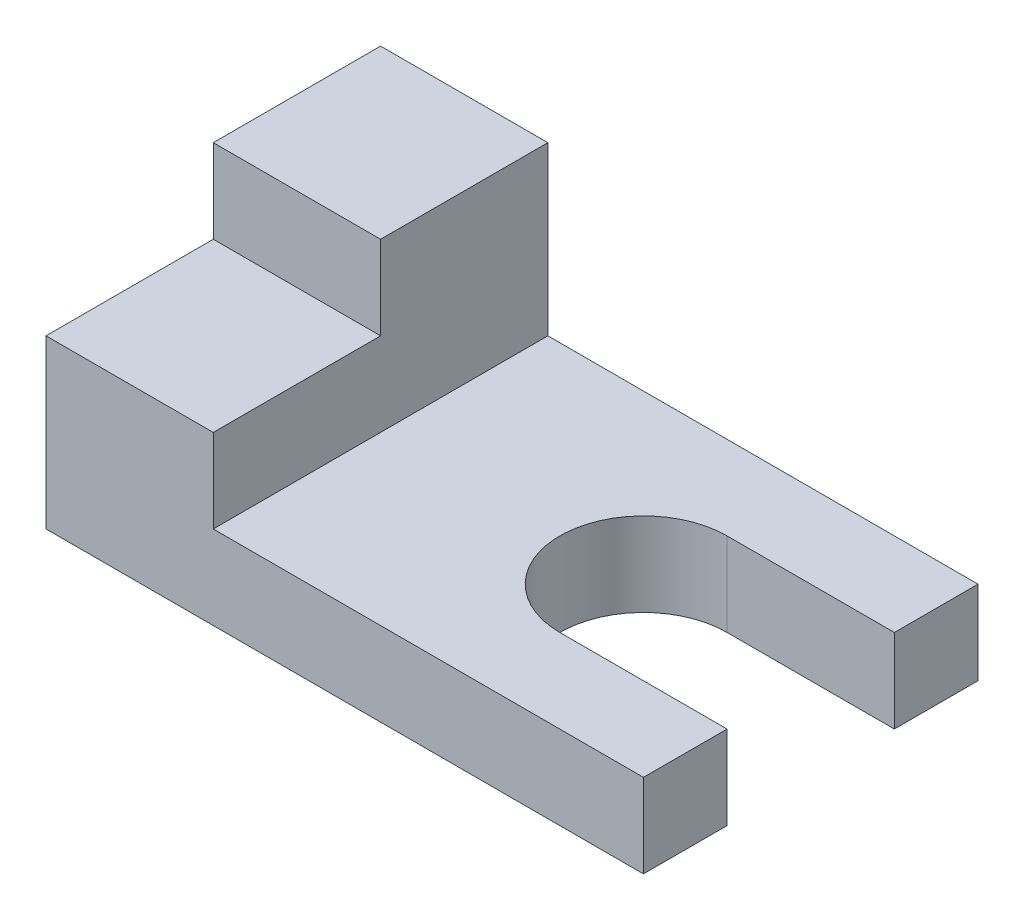
ISO-10303-21;
HEADER;
FILE_DESCRIPTION(('STEP AP214'),'2;1');
FILE_NAME('part.step','',(''),(''),'','','');
FILE_SCHEMA(('AUTOMOTIVE_DESIGN { 1 0 10303 214 1 1 1 1 }'));
ENDSEC;
DATA;
#1=APPLICATION_CONTEXT('core data for automotive mechanical design processes');
#2=APPLICATION_PROTOCOL_DEFINITION('international standard','automotive_design',2000,#1);
#3=PRODUCT_CONTEXT('',#1,'mechanical');
#4=PRODUCT('Part','Part','',(#3));
#5=PRODUCT_RELATED_PRODUCT_CATEGORY('part','',(#4));
#6=PRODUCT_DEFINITION_FORMATION('','',#4);
#7=PRODUCT_DEFINITION_CONTEXT('part definition',#1,'design');
#8=PRODUCT_DEFINITION('design','',#6,#7);
#9=PRODUCT_DEFINITION_SHAPE('','',#8);
#10=(LENGTH_UNIT() NAMED_UNIT(*) SI_UNIT(.MILLI.,.METRE.));
#11=(NAMED_UNIT(*) PLANE_ANGLE_UNIT() SI_UNIT($,.RADIAN.));
#12=(NAMED_UNIT(*) SI_UNIT($,.STERADIAN.) SOLID_ANGLE_UNIT());
#13=UNCERTAINTY_MEASURE_WITH_UNIT(LENGTH_MEASURE(1.E-05),#10,'distance_accuracy_value','');
#14=(GEOMETRIC_REPRESENTATION_CONTEXT(3) GLOBAL_UNCERTAINTY_ASSIGNED_CONTEXT((#13)) GLOBAL_UNIT_ASSIGNED_CONTEXT((#10,
#11,#12)) REPRESENTATION_CONTEXT('',''));
#15=CARTESIAN_POINT('',(0.,0.,0.));
#16=DIRECTION('',(0.,0.,1.));
#17=DIRECTION('',(1.,0.,0.));
#18=AXIS2_PLACEMENT_3D('',#15,#16,#17);
#19=CARTESIAN_POINT('',(-14.,7.,0.));
#20=DIRECTION('',(0.,1.,0.));
#21=DIRECTION('',(0.,0.,1.));
#22=AXIS2_PLACEMENT_3D('',#19,#20,#21);
#23=PLANE('',#22);
#24=DIRECTION('',(1.,0.,0.));
#25=VECTOR('',#24,1.);
#26=CARTESIAN_POINT('',(0.,7.,-14.));
#27=LINE('',#26,#25);
#28=CARTESIAN_POINT('',(-36.,7.,-14.));
#29=VERTEX_POINT('',#28);
#30=CARTESIAN_POINT('',(0.,7.,-14.));
#31=VERTEX_POINT('',#30);
#32=EDGE_CURVE('E169',#29,#31,#27,.T.);
#33=ORIENTED_EDGE('',*,*,#32,.F.);
#34=DIRECTION('',(0.,0.,1.));
#35=VECTOR('',#34,1.);
#36=CARTESIAN_POINT('',(-36.,7.,0.));
#37=LINE('',#36,#35);
#38=CARTESIAN_POINT('',(-36.,7.,14.));
#39=VERTEX_POINT('',#38);
#40=EDGE_CURVE('E56',#29,#39,#37,.T.);
#41=ORIENTED_EDGE('',*,*,#40,.T.);
#42=DIRECTION('',(1.,0.,0.));
#43=VECTOR('',#42,1.);
#44=CARTESIAN_POINT('',(0.,7.,14.));
#45=LINE('',#44,#43);
#46=CARTESIAN_POINT('',(0.,7.,14.));
#47=VERTEX_POINT('',#46);
#48=EDGE_CURVE('E197',#39,#47,#45,.T.);
#49=ORIENTED_EDGE('',*,*,#48,.T.);
#50=DIRECTION('',(0.,0.,-1.));
#51=VECTOR('',#50,1.);
#52=CARTESIAN_POINT('',(0.,7.,7.));
#53=LINE('',#52,#51);
#54=CARTESIAN_POINT('',(0.,7.,7.));
#55=VERTEX_POINT('',#54);
#56=EDGE_CURVE('E199',#47,#55,#53,.T.);
#57=ORIENTED_EDGE('',*,*,#56,.T.);
#58=DIRECTION('',(-1.,0.,0.));
#59=VECTOR('',#58,1.);
#60=CARTESIAN_POINT('',(-14.,7.,7.));
#61=LINE('',#60,#59);
#62=CARTESIAN_POINT('',(-14.,7.,7.));
#63=VERTEX_POINT('',#62);
#64=EDGE_CURVE('E202',#55,#63,#61,.T.);
#65=ORIENTED_EDGE('',*,*,#64,.T.);
#66=CARTESIAN_POINT('',(-14.,7.,0.));
#67=DIRECTION('',(0.,-1.,0.));
#68=DIRECTION('',(0.,0.,1.));
#69=AXIS2_PLACEMENT_3D('',#66,#67,#68);
#70=CIRCLE('',#69,7.);
#71=CARTESIAN_POINT('',(-14.,7.,-7.));
#72=VERTEX_POINT('',#71);
#73=EDGE_CURVE('E204',#63,#72,#70,.T.);
#74=ORIENTED_EDGE('',*,*,#73,.T.);
#75=DIRECTION('',(-1.,0.,0.));
#76=VECTOR('',#75,1.);
#77=CARTESIAN_POINT('',(-14.,7.,-7.));
#78=LINE('',#77,#76);
#79=CARTESIAN_POINT('',(0.,7.,-7.));
#80=VERTEX_POINT('',#79);
#81=EDGE_CURVE('E175',#80,#72,#78,.T.);
#82=ORIENTED_EDGE('',*,*,#81,.F.);
#83=DIRECTION('',(0.,0.,1.));
#84=VECTOR('',#83,1.);
#85=CARTESIAN_POINT('',(0.,7.,-7.));
#86=LINE('',#85,#84);
#87=EDGE_CURVE('E171',#31,#80,#86,.T.);
#88=ORIENTED_EDGE('',*,*,#87,.F.);
#89=EDGE_LOOP('',(#33,#41,#49,#57,#65,#74,#82,#88));
#90=FACE_BOUND('',#89,.T.);
#91=ADVANCED_FACE('F41',(#90),#23,.T.);
#92=CARTESIAN_POINT('',(-50.,7.,14.));
#93=DIRECTION('',(1.,0.,0.));
#94=DIRECTION('',(0.,0.,-1.));
#95=AXIS2_PLACEMENT_3D('',#92,#93,#94);
#96=PLANE('',#95);
#97=DIRECTION('',(0.,0.,1.));
#98=VECTOR('',#97,1.);
#99=CARTESIAN_POINT('',(-50.,0.,14.));
#100=LINE('',#99,#98);
#101=CARTESIAN_POINT('',(-50.,0.,-14.));
#102=VERTEX_POINT('',#101);
#103=CARTESIAN_POINT('',(-50.,0.,14.));
#104=VERTEX_POINT('',#103);
#105=EDGE_CURVE('E196',#102,#104,#100,.T.);
#106=ORIENTED_EDGE('',*,*,#105,.T.);
#107=DIRECTION('',(0.,-1.,0.));
#108=VECTOR('',#107,1.);
#109=CARTESIAN_POINT('',(-50.,7.,14.));
#110=LINE('',#109,#108);
#111=CARTESIAN_POINT('',(-50.,14.,14.));
#112=VERTEX_POINT('',#111);
#113=EDGE_CURVE('E11',#112,#104,#110,.T.);
#114=ORIENTED_EDGE('',*,*,#113,.F.);
#115=DIRECTION('',(0.,0.,1.));
#116=VECTOR('',#115,1.);
#117=CARTESIAN_POINT('',(-50.,14.,0.));
#118=LINE('',#117,#116);
#119=CARTESIAN_POINT('',(-50.,14.,0.));
#120=VERTEX_POINT('',#119);
#121=EDGE_CURVE('E152',#120,#112,#118,.T.);
#122=ORIENTED_EDGE('',*,*,#121,.F.);
#123=DIRECTION('',(0.,-1.,0.));
#124=VECTOR('',#123,1.);
#125=CARTESIAN_POINT('',(-50.,21.,0.));
#126=LINE('',#125,#124);
#127=CARTESIAN_POINT('',(-50.,21.,0.));
#128=VERTEX_POINT('',#127);
#129=EDGE_CURVE('E134',#128,#120,#126,.T.);
#130=ORIENTED_EDGE('',*,*,#129,.F.);
#131=DIRECTION('',(0.,0.,1.));
#132=VECTOR('',#131,1.);
#133=CARTESIAN_POINT('',(-50.,21.,0.));
#134=LINE('',#133,#132);
#135=CARTESIAN_POINT('',(-50.,21.,-14.));
#136=VERTEX_POINT('',#135);
#137=EDGE_CURVE('E141',#136,#128,#134,.T.);
#138=ORIENTED_EDGE('',*,*,#137,.F.);
#139=DIRECTION('',(0.,-1.,0.));
#140=VECTOR('',#139,1.);
#141=CARTESIAN_POINT('',(-50.,7.,-14.));
#142=LINE('',#141,#140);
#143=EDGE_CURVE('E194',#136,#102,#142,.T.);
#144=ORIENTED_EDGE('',*,*,#143,.T.);
#145=EDGE_LOOP('',(#106,#114,#122,#130,#138,#144));
#146=FACE_BOUND('',#145,.T.);
#147=ADVANCED_FACE('F43',(#146),#96,.F.);
#148=CARTESIAN_POINT('',(0.,7.,14.));
#149=DIRECTION('',(0.,0.,-1.));
#150=DIRECTION('',(-1.,0.,0.));
#151=AXIS2_PLACEMENT_3D('',#148,#149,#150);
#152=PLANE('',#151);
#153=DIRECTION('',(1.,0.,0.));
#154=VECTOR('',#153,1.);
#155=CARTESIAN_POINT('',(0.,0.,14.));
#156=LINE('',#155,#154);
#157=CARTESIAN_POINT('',(0.,0.,14.));
#158=VERTEX_POINT('',#157);
#159=EDGE_CURVE('E208',#104,#158,#156,.T.);
#160=ORIENTED_EDGE('',*,*,#159,.T.);
#161=DIRECTION('',(0.,-1.,0.));
#162=VECTOR('',#161,1.);
#163=CARTESIAN_POINT('',(0.,7.,14.));
#164=LINE('',#163,#162);
#165=EDGE_CURVE('E49',#47,#158,#164,.T.);
#166=ORIENTED_EDGE('',*,*,#165,.F.);
#167=ORIENTED_EDGE('',*,*,#48,.F.);
#168=DIRECTION('',(0.,-1.,0.));
#169=VECTOR('',#168,1.);
#170=CARTESIAN_POINT('',(-36.,14.,14.));
#171=LINE('',#170,#169);
#172=CARTESIAN_POINT('',(-36.,14.,14.));
#173=VERTEX_POINT('',#172);
#174=EDGE_CURVE('E61',#173,#39,#171,.T.);
#175=ORIENTED_EDGE('',*,*,#174,.F.);
#176=DIRECTION('',(1.,0.,0.));
#177=VECTOR('',#176,1.);
#178=CARTESIAN_POINT('',(0.,14.,14.));
#179=LINE('',#178,#177);
#180=EDGE_CURVE('E163',#112,#173,#179,.T.);
#181=ORIENTED_EDGE('',*,*,#180,.F.);
#182=ORIENTED_EDGE('',*,*,#113,.T.);
#183=EDGE_LOOP('',(#160,#166,#167,#175,#181,#182));
#184=FACE_BOUND('',#183,.T.);
#185=ADVANCED_FACE('F244',(#184),#152,.F.);
#186=CARTESIAN_POINT('',(0.,7.,7.));
#187=DIRECTION('',(-1.,0.,0.));
#188=DIRECTION('',(0.,0.,1.));
#189=AXIS2_PLACEMENT_3D('',#186,#187,#188);
#190=PLANE('',#189);
#191=DIRECTION('',(0.,0.,-1.));
#192=VECTOR('',#191,1.);
#193=CARTESIAN_POINT('',(0.,0.,7.));
#194=LINE('',#193,#192);
#195=CARTESIAN_POINT('',(0.,0.,7.));
#196=VERTEX_POINT('',#195);
#197=EDGE_CURVE('E210',#158,#196,#194,.T.);
#198=ORIENTED_EDGE('',*,*,#197,.T.);
#199=DIRECTION('',(0.,-1.,0.));
#200=VECTOR('',#199,1.);
#201=CARTESIAN_POINT('',(0.,7.,7.));
#202=LINE('',#201,#200);
#203=EDGE_CURVE('E217',#55,#196,#202,.T.);
#204=ORIENTED_EDGE('',*,*,#203,.F.);
#205=ORIENTED_EDGE('',*,*,#56,.F.);
#206=ORIENTED_EDGE('',*,*,#165,.T.);
#207=EDGE_LOOP('',(#198,#204,#205,#206));
#208=FACE_BOUND('',#207,.T.);
#209=ADVANCED_FACE('F224',(#208),#190,.F.);
#210=CARTESIAN_POINT('',(-14.,7.,7.));
#211=DIRECTION('',(0.,0.,1.));
#212=DIRECTION('',(1.,0.,0.));
#213=AXIS2_PLACEMENT_3D('',#210,#211,#212);
#214=PLANE('',#213);
#215=DIRECTION('',(-1.,0.,0.));
#216=VECTOR('',#215,1.);
#217=CARTESIAN_POINT('',(-14.,0.,7.));
#218=LINE('',#217,#216);
#219=CARTESIAN_POINT('',(-14.,0.,7.));
#220=VERTEX_POINT('',#219);
#221=EDGE_CURVE('E212',#196,#220,#218,.T.);
#222=ORIENTED_EDGE('',*,*,#221,.T.);
#223=DIRECTION('',(0.,-1.,0.));
#224=VECTOR('',#223,1.);
#225=CARTESIAN_POINT('',(-14.,7.,7.));
#226=LINE('',#225,#224);
#227=EDGE_CURVE('E206',#63,#220,#226,.T.);
#228=ORIENTED_EDGE('',*,*,#227,.F.);
#229=ORIENTED_EDGE('',*,*,#64,.F.);
#230=ORIENTED_EDGE('',*,*,#203,.T.);
#231=EDGE_LOOP('',(#222,#228,#229,#230));
#232=FACE_BOUND('',#231,.T.);
#233=ADVANCED_FACE('F235',(#232),#214,.F.);
#234=CARTESIAN_POINT('',(-14.,7.,0.));
#235=DIRECTION('',(0.,-1.,0.));
#236=DIRECTION('',(0.,0.,-1.));
#237=AXIS2_PLACEMENT_3D('',#234,#235,#236);
#238=CYLINDRICAL_SURFACE('',#237,7.);
#239=CARTESIAN_POINT('',(-14.,0.,0.));
#240=DIRECTION('',(0.,-1.,0.));
#241=DIRECTION('',(0.,0.,1.));
#242=AXIS2_PLACEMENT_3D('',#239,#240,#241);
#243=CIRCLE('',#242,7.);
#244=CARTESIAN_POINT('',(-14.,0.,-7.));
#245=VERTEX_POINT('',#244);
#246=EDGE_CURVE('E200',#220,#245,#243,.T.);
#247=ORIENTED_EDGE('',*,*,#246,.T.);
#248=DIRECTION('',(0.,-1.,0.));
#249=VECTOR('',#248,1.);
#250=CARTESIAN_POINT('',(-14.,7.,-7.));
#251=LINE('',#250,#249);
#252=EDGE_CURVE('E178',#72,#245,#251,.T.);
#253=ORIENTED_EDGE('',*,*,#252,.F.);
#254=ORIENTED_EDGE('',*,*,#73,.F.);
#255=ORIENTED_EDGE('',*,*,#227,.T.);
#256=EDGE_LOOP('',(#247,#253,#254,#255));
#257=FACE_BOUND('',#256,.T.);
#258=ADVANCED_FACE('F239',(#257),#238,.F.);
#259=CARTESIAN_POINT('',(-14.,0.,0.));
#260=DIRECTION('',(0.,1.,0.));
#261=DIRECTION('',(0.,0.,1.));
#262=AXIS2_PLACEMENT_3D('',#259,#260,#261);
#263=PLANE('',#262);
#264=ORIENTED_EDGE('',*,*,#105,.F.);
#265=DIRECTION('',(1.,0.,0.));
#266=VECTOR('',#265,1.);
#267=CARTESIAN_POINT('',(0.,0.,-14.));
#268=LINE('',#267,#266);
#269=CARTESIAN_POINT('',(0.,0.,-14.));
#270=VERTEX_POINT('',#269);
#271=EDGE_CURVE('E168',#102,#270,#268,.T.);
#272=ORIENTED_EDGE('',*,*,#271,.T.);
#273=DIRECTION('',(0.,0.,1.));
#274=VECTOR('',#273,1.);
#275=CARTESIAN_POINT('',(0.,0.,-7.));
#276=LINE('',#275,#274);
#277=CARTESIAN_POINT('',(0.,0.,-7.));
#278=VERTEX_POINT('',#277);
#279=EDGE_CURVE('E181',#270,#278,#276,.T.);
#280=ORIENTED_EDGE('',*,*,#279,.T.);
#281=DIRECTION('',(-1.,0.,0.));
#282=VECTOR('',#281,1.);
#283=CARTESIAN_POINT('',(-14.,0.,-7.));
#284=LINE('',#283,#282);
#285=EDGE_CURVE('E172',#278,#245,#284,.T.);
#286=ORIENTED_EDGE('',*,*,#285,.T.);
#287=ORIENTED_EDGE('',*,*,#246,.F.);
#288=ORIENTED_EDGE('',*,*,#221,.F.);
#289=ORIENTED_EDGE('',*,*,#197,.F.);
#290=ORIENTED_EDGE('',*,*,#159,.F.);
#291=EDGE_LOOP('',(#264,#272,#280,#286,#287,#288,#289,#290));
#292=FACE_BOUND('',#291,.T.);
#293=ADVANCED_FACE('F231',(#292),#263,.F.);
#294=CARTESIAN_POINT('',(0.,7.,-14.));
#295=DIRECTION('',(0.,0.,1.));
#296=DIRECTION('',(-1.,0.,0.));
#297=AXIS2_PLACEMENT_3D('',#294,#295,#296);
#298=PLANE('',#297);
#299=ORIENTED_EDGE('',*,*,#271,.F.);
#300=ORIENTED_EDGE('',*,*,#143,.F.);
#301=DIRECTION('',(-1.,0.,0.));
#302=VECTOR('',#301,1.);
#303=CARTESIAN_POINT('',(0.,21.,-14.));
#304=LINE('',#303,#302);
#305=CARTESIAN_POINT('',(-36.,21.,-14.));
#306=VERTEX_POINT('',#305);
#307=EDGE_CURVE('E147',#306,#136,#304,.T.);
#308=ORIENTED_EDGE('',*,*,#307,.F.);
#309=DIRECTION('',(0.,-1.,0.));
#310=VECTOR('',#309,1.);
#311=CARTESIAN_POINT('',(-36.,21.,-14.));
#312=LINE('',#311,#310);
#313=EDGE_CURVE('E157',#306,#29,#312,.T.);
#314=ORIENTED_EDGE('',*,*,#313,.T.);
#315=ORIENTED_EDGE('',*,*,#32,.T.);
#316=DIRECTION('',(0.,-1.,0.));
#317=VECTOR('',#316,1.);
#318=CARTESIAN_POINT('',(0.,7.,-14.));
#319=LINE('',#318,#317);
#320=EDGE_CURVE('E191',#31,#270,#319,.T.);
#321=ORIENTED_EDGE('',*,*,#320,.T.);
#322=EDGE_LOOP('',(#299,#300,#308,#314,#315,#321));
#323=FACE_BOUND('',#322,.T.);
#324=ADVANCED_FACE('F266',(#323),#298,.F.);
#325=CARTESIAN_POINT('',(0.,7.,-7.));
#326=DIRECTION('',(-1.,0.,0.));
#327=DIRECTION('',(0.,0.,-1.));
#328=AXIS2_PLACEMENT_3D('',#325,#326,#327);
#329=PLANE('',#328);
#330=ORIENTED_EDGE('',*,*,#279,.F.);
#331=ORIENTED_EDGE('',*,*,#320,.F.);
#332=ORIENTED_EDGE('',*,*,#87,.T.);
#333=DIRECTION('',(0.,-1.,0.));
#334=VECTOR('',#333,1.);
#335=CARTESIAN_POINT('',(0.,7.,-7.));
#336=LINE('',#335,#334);
#337=EDGE_CURVE('E188',#80,#278,#336,.T.);
#338=ORIENTED_EDGE('',*,*,#337,.T.);
#339=EDGE_LOOP('',(#330,#331,#332,#338));
#340=FACE_BOUND('',#339,.T.);
#341=ADVANCED_FACE('F285',(#340),#329,.F.);
#342=CARTESIAN_POINT('',(-14.,7.,-7.));
#343=DIRECTION('',(0.,0.,-1.));
#344=DIRECTION('',(1.,0.,0.));
#345=AXIS2_PLACEMENT_3D('',#342,#343,#344);
#346=PLANE('',#345);
#347=ORIENTED_EDGE('',*,*,#285,.F.);
#348=ORIENTED_EDGE('',*,*,#337,.F.);
#349=ORIENTED_EDGE('',*,*,#81,.T.);
#350=ORIENTED_EDGE('',*,*,#252,.T.);
#351=EDGE_LOOP('',(#347,#348,#349,#350));
#352=FACE_BOUND('',#351,.T.);
#353=ADVANCED_FACE('F256',(#352),#346,.F.);
#354=CARTESIAN_POINT('',(-36.,14.,0.));
#355=DIRECTION('',(1.,0.,0.));
#356=DIRECTION('',(0.,0.,-1.));
#357=AXIS2_PLACEMENT_3D('',#354,#355,#356);
#358=PLANE('',#357);
#359=ORIENTED_EDGE('',*,*,#40,.F.);
#360=ORIENTED_EDGE('',*,*,#313,.F.);
#361=DIRECTION('',(0.,0.,1.));
#362=VECTOR('',#361,1.);
#363=CARTESIAN_POINT('',(-36.,21.,0.));
#364=LINE('',#363,#362);
#365=CARTESIAN_POINT('',(-36.,21.,0.));
#366=VERTEX_POINT('',#365);
#367=EDGE_CURVE('E140',#306,#366,#364,.T.);
#368=ORIENTED_EDGE('',*,*,#367,.T.);
#369=DIRECTION('',(0.,-1.,0.));
#370=VECTOR('',#369,1.);
#371=CARTESIAN_POINT('',(-36.,21.,0.));
#372=LINE('',#371,#370);
#373=CARTESIAN_POINT('',(-36.,14.,0.));
#374=VERTEX_POINT('',#373);
#375=EDGE_CURVE('E136',#366,#374,#372,.T.);
#376=ORIENTED_EDGE('',*,*,#375,.T.);
#377=DIRECTION('',(0.,0.,1.));
#378=VECTOR('',#377,1.);
#379=CARTESIAN_POINT('',(-36.,14.,0.));
#380=LINE('',#379,#378);
#381=EDGE_CURVE('E165',#374,#173,#380,.T.);
#382=ORIENTED_EDGE('',*,*,#381,.T.);
#383=ORIENTED_EDGE('',*,*,#174,.T.);
#384=EDGE_LOOP('',(#359,#360,#368,#376,#382,#383));
#385=FACE_BOUND('',#384,.T.);
#386=ADVANCED_FACE('F246',(#385),#358,.T.);
#387=CARTESIAN_POINT('',(0.,14.,0.));
#388=DIRECTION('',(0.,1.,0.));
#389=DIRECTION('',(0.,0.,1.));
#390=AXIS2_PLACEMENT_3D('',#387,#388,#389);
#391=PLANE('',#390);
#392=DIRECTION('',(1.,0.,0.));
#393=VECTOR('',#392,1.);
#394=CARTESIAN_POINT('',(0.,14.,0.));
#395=LINE('',#394,#393);
#396=EDGE_CURVE('E155',#120,#374,#395,.T.);
#397=ORIENTED_EDGE('',*,*,#396,.F.);
#398=ORIENTED_EDGE('',*,*,#121,.T.);
#399=ORIENTED_EDGE('',*,*,#180,.T.);
#400=ORIENTED_EDGE('',*,*,#381,.F.);
#401=EDGE_LOOP('',(#397,#398,#399,#400));
#402=FACE_BOUND('',#401,.T.);
#403=ADVANCED_FACE('F248',(#402),#391,.T.);
#404=CARTESIAN_POINT('',(0.,21.,0.));
#405=DIRECTION('',(0.,0.,-1.));
#406=DIRECTION('',(-1.,0.,0.));
#407=AXIS2_PLACEMENT_3D('',#404,#405,#406);
#408=PLANE('',#407);
#409=ORIENTED_EDGE('',*,*,#396,.T.);
#410=ORIENTED_EDGE('',*,*,#375,.F.);
#411=DIRECTION('',(1.,0.,0.));
#412=VECTOR('',#411,1.);
#413=CARTESIAN_POINT('',(0.,21.,0.));
#414=LINE('',#413,#412);
#415=EDGE_CURVE('E129',#128,#366,#414,.T.);
#416=ORIENTED_EDGE('',*,*,#415,.F.);
#417=ORIENTED_EDGE('',*,*,#129,.T.);
#418=EDGE_LOOP('',(#409,#410,#416,#417));
#419=FACE_BOUND('',#418,.T.);
#420=ADVANCED_FACE('F132',(#419),#408,.F.);
#421=CARTESIAN_POINT('',(0.,21.,0.));
#422=DIRECTION('',(0.,1.,0.));
#423=DIRECTION('',(0.,0.,1.));
#424=AXIS2_PLACEMENT_3D('',#421,#422,#423);
#425=PLANE('',#424);
#426=ORIENTED_EDGE('',*,*,#137,.T.);
#427=ORIENTED_EDGE('',*,*,#415,.T.);
#428=ORIENTED_EDGE('',*,*,#367,.F.);
#429=ORIENTED_EDGE('',*,*,#307,.T.);
#430=EDGE_LOOP('',(#426,#427,#428,#429));
#431=FACE_BOUND('',#430,.T.);
#432=ADVANCED_FACE('F145',(#431),#425,.T.);
#433=CLOSED_SHELL('',(#91,#147,#185,#209,#233,#258,#293,#324,#341,#353,#386,#403,#420,#432));
#434=MANIFOLD_SOLID_BREP('B2',#433);
#435=ADVANCED_BREP_SHAPE_REPRESENTATION('',(#18,#434),#14);
#436=SHAPE_DEFINITION_REPRESENTATION(#9,#435);
ENDSEC;
END-ISO-10303-21;
